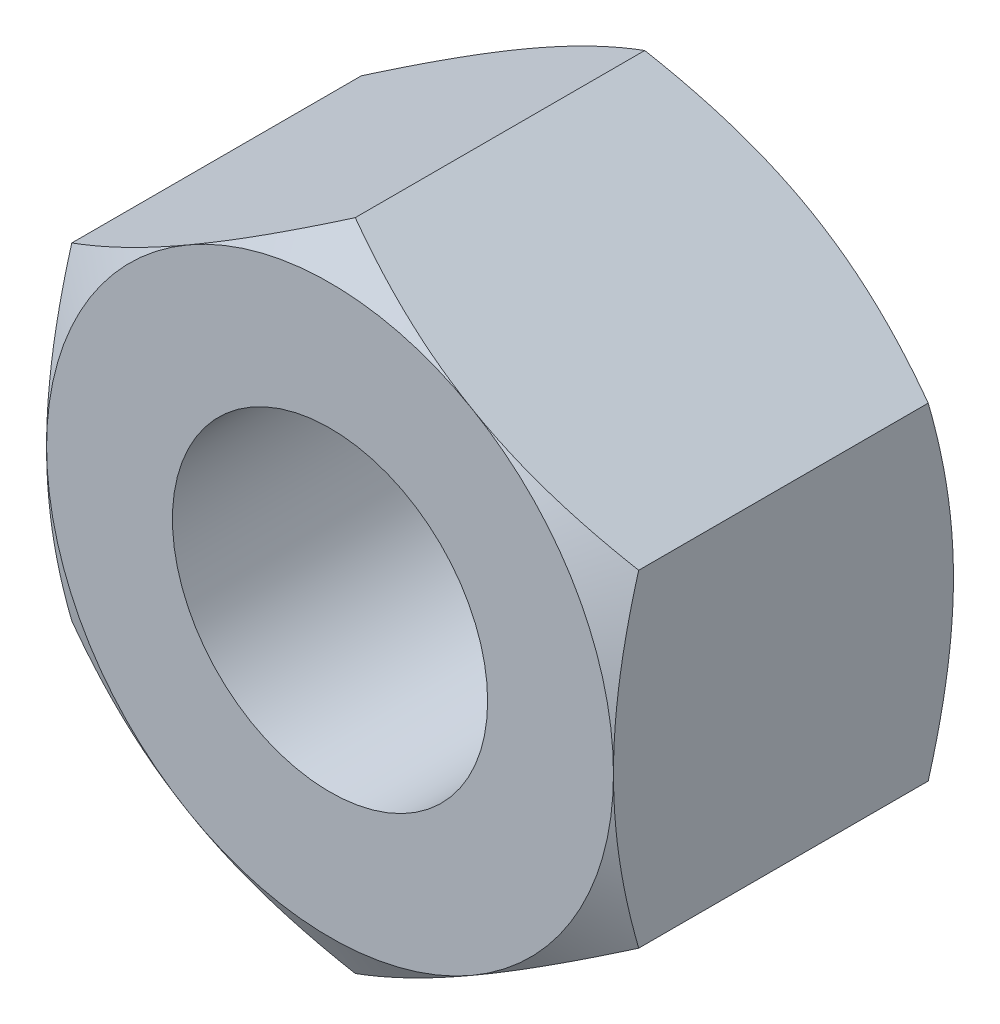
ISO-10303-21;
HEADER;
FILE_DESCRIPTION(('STEP AP214'),'2;1');
FILE_NAME('part.step','',(''),(''),'','','');
FILE_SCHEMA(('AUTOMOTIVE_DESIGN { 1 0 10303 214 1 1 1 1 }'));
ENDSEC;
DATA;
#1=APPLICATION_CONTEXT('core data for automotive mechanical design processes');
#2=APPLICATION_PROTOCOL_DEFINITION('international standard','automotive_design',2000,#1);
#3=PRODUCT_CONTEXT('',#1,'mechanical');
#4=PRODUCT('Part','Part','',(#3));
#5=PRODUCT_RELATED_PRODUCT_CATEGORY('part','',(#4));
#6=PRODUCT_DEFINITION_FORMATION('','',#4);
#7=PRODUCT_DEFINITION_CONTEXT('part definition',#1,'design');
#8=PRODUCT_DEFINITION('design','',#6,#7);
#9=PRODUCT_DEFINITION_SHAPE('','',#8);
#10=(LENGTH_UNIT() NAMED_UNIT(*) SI_UNIT(.MILLI.,.METRE.));
#11=(NAMED_UNIT(*) PLANE_ANGLE_UNIT() SI_UNIT($,.RADIAN.));
#12=(NAMED_UNIT(*) SI_UNIT($,.STERADIAN.) SOLID_ANGLE_UNIT());
#13=UNCERTAINTY_MEASURE_WITH_UNIT(LENGTH_MEASURE(1.E-05),#10,'distance_accuracy_value','');
#14=(GEOMETRIC_REPRESENTATION_CONTEXT(3) GLOBAL_UNCERTAINTY_ASSIGNED_CONTEXT((#13)) GLOBAL_UNIT_ASSIGNED_CONTEXT((#10,
#11,#12)) REPRESENTATION_CONTEXT('',''));
#15=CARTESIAN_POINT('',(0.,0.,0.));
#16=DIRECTION('',(0.,0.,1.));
#17=DIRECTION('',(1.,0.,0.));
#18=AXIS2_PLACEMENT_3D('',#15,#16,#17);
#19=CARTESIAN_POINT('',(0.,8.24155962262807,-8.5598));
#20=DIRECTION('',(-0.500000000000001,0.866025403784438,0.));
#21=DIRECTION('',(-0.866025403784438,-0.500000000000001,0.));
#22=AXIS2_PLACEMENT_3D('',#19,#20,#21);
#23=PLANE('',#22);
#24=DIRECTION('',(0.,0.,1.));
#25=VECTOR('',#24,1.);
#26=CARTESIAN_POINT('',(-7.1374,4.12077981131403,-8.5598));
#27=LINE('',#26,#25);
#28=CARTESIAN_POINT('',(-7.1374,4.12077981131405,-7.9248));
#29=VERTEX_POINT('',#28);
#30=CARTESIAN_POINT('',(-7.1374,4.12077981131403,-0.634999999999996));
#31=VERTEX_POINT('',#30);
#32=EDGE_CURVE('E163',#29,#31,#27,.T.);
#33=ORIENTED_EDGE('',*,*,#32,.T.);
#34=CARTESIAN_POINT('',(-7.1376,4.12066434126019,-0.635066407993581));
#35=CARTESIAN_POINT('',(-6.98076647484934,4.21121221922388,-0.583000288783407));
#36=CARTESIAN_POINT('',(-6.82335257460106,4.30209517690642,-0.533297818026336));
#37=CARTESIAN_POINT('',(-6.50725643555729,4.48459336787314,-0.439269681753373));
#38=CARTESIAN_POINT('',(-6.34857368567719,4.57620889623216,-0.394946312619536));
#39=CARTESIAN_POINT('',(-5.87000596411676,4.85251009910054,-0.270913911740814));
#40=CARTESIAN_POINT('',(-5.54824691951738,5.03827777011419,-0.200362540472032));
#41=CARTESIAN_POINT('',(-5.06673137153193,5.31628090136258,-0.117608359317688));
#42=CARTESIAN_POINT('',(-4.90840201346526,5.407692398863,-0.0940278001674196));
#43=CARTESIAN_POINT('',(-4.59103316203148,5.5909253906707,-0.0544777987104414));
#44=CARTESIAN_POINT('',(-4.43199373207493,5.68274684836787,-0.0385076899774345));
#45=CARTESIAN_POINT('',(-4.11363981497499,5.8665485681031,-0.0145841603820937));
#46=CARTESIAN_POINT('',(-3.954325839264,5.95852853486551,-0.00662173202293361));
#47=CARTESIAN_POINT('',(-3.63555964308717,6.14256828403675,0.00112449461758829));
#48=CARTESIAN_POINT('',(-3.47610742698757,6.23462806392474,0.000908542426211805));
#49=CARTESIAN_POINT('',(-3.03899670478565,6.48699405705369,-0.0109328282219934));
#50=CARTESIAN_POINT('',(-2.76147915657837,6.64721888821601,-0.0309109182896473));
#51=CARTESIAN_POINT('',(-2.20827221712257,6.96661306362839,-0.0943334019128988));
#52=CARTESIAN_POINT('',(-1.93258473918294,7.12578130322904,-0.137799332626333));
#53=CARTESIAN_POINT('',(-1.37827011982301,7.44581499793224,-0.246478861077877));
#54=CARTESIAN_POINT('',(-1.09971191681562,7.60664065142354,-0.312150254483647));
#55=CARTESIAN_POINT('',(-0.54672023974519,7.92591054503977,-0.461222792086858));
#56=CARTESIAN_POINT('',(-0.272279791691294,8.08435881160021,-0.544589172809348));
#57=CARTESIAN_POINT('',(0.000200000000000839,8.24167509268191,-0.635066407993585));
#58=B_SPLINE_CURVE_WITH_KNOTS('',3,(#34,#35,#36,#37,#38,#39,#40,#41,#42,#43,#44,#45,#46,#47,#48,
#49,#50,#51,#52,#53,#54,#55,#56,#57),.UNSPECIFIED.,.F.,.F.,(4,2,2,2,2,2,2,2,2,2,2,4),(0.,
0.565250699787999,1.13074186710046,2.26405155735559,2.81693591615959,3.36977185149424,
3.92198522745296,4.47418175506626,5.43639409933182,6.39949024436028,7.38379317493729,
8.36617995763132),.UNSPECIFIED.);
#59=CARTESIAN_POINT('',(-3.56870000000001,6.18116971697105,0.));
#60=VERTEX_POINT('',#59);
#61=EDGE_CURVE('E59',#31,#60,#58,.T.);
#62=ORIENTED_EDGE('',*,*,#61,.T.);
#63=CARTESIAN_POINT('',(0.,8.24155962262807,-0.635));
#64=VERTEX_POINT('',#63);
#65=EDGE_CURVE('E205',#60,#64,#58,.T.);
#66=ORIENTED_EDGE('',*,*,#65,.T.);
#67=DIRECTION('',(0.,0.,1.));
#68=VECTOR('',#67,1.);
#69=CARTESIAN_POINT('',(0.,8.24155962262807,-8.5598));
#70=LINE('',#69,#68);
#71=CARTESIAN_POINT('',(0.,8.24155962262807,-7.9248));
#72=VERTEX_POINT('',#71);
#73=EDGE_CURVE('E148',#72,#64,#70,.T.);
#74=ORIENTED_EDGE('',*,*,#73,.F.);
#75=CARTESIAN_POINT('',(-7.1376,4.12066434126019,-7.92473359200642));
#76=CARTESIAN_POINT('',(-6.98076647484934,4.21121221922388,-7.97679971121659));
#77=CARTESIAN_POINT('',(-6.82335257460106,4.30209517690642,-8.02650218197367));
#78=CARTESIAN_POINT('',(-6.50725643555729,4.48459336787314,-8.12053031824663));
#79=CARTESIAN_POINT('',(-6.3485736856772,4.57620889623216,-8.16485368738046));
#80=CARTESIAN_POINT('',(-5.87000596411677,4.85251009910054,-8.28888608825919));
#81=CARTESIAN_POINT('',(-5.54824691951738,5.03827777011419,-8.35943745952797));
#82=CARTESIAN_POINT('',(-5.06673137153194,5.31628090136258,-8.44219164068231));
#83=CARTESIAN_POINT('',(-4.90840201346526,5.407692398863,-8.46577219983258));
#84=CARTESIAN_POINT('',(-4.59103316203148,5.59092539067069,-8.50532220128956));
#85=CARTESIAN_POINT('',(-4.43199373207493,5.68274684836787,-8.52129231002257));
#86=CARTESIAN_POINT('',(-4.11363981497499,5.86654856810309,-8.54521583961791));
#87=CARTESIAN_POINT('',(-3.954325839264,5.95852853486551,-8.55317826797707));
#88=CARTESIAN_POINT('',(-3.63555964308717,6.14256828403675,-8.56092449461759));
#89=CARTESIAN_POINT('',(-3.47610742698757,6.23462806392474,-8.56070854242621));
#90=CARTESIAN_POINT('',(-3.03899670478565,6.48699405705369,-8.54886717177801));
#91=CARTESIAN_POINT('',(-2.76147915657837,6.64721888821601,-8.52888908171035));
#92=CARTESIAN_POINT('',(-2.20827221712257,6.96661306362838,-8.4654665980871));
#93=CARTESIAN_POINT('',(-1.93258473918294,7.12578130322904,-8.42200066737367));
#94=CARTESIAN_POINT('',(-1.378270119823,7.44581499793224,-8.31332113892212));
#95=CARTESIAN_POINT('',(-1.09971191681562,7.60664065142354,-8.24764974551636));
#96=CARTESIAN_POINT('',(-0.54672023974519,7.92591054503977,-8.09857720791314));
#97=CARTESIAN_POINT('',(-0.272279791691295,8.08435881160021,-8.01521082719065));
#98=CARTESIAN_POINT('',(0.000200000000000537,8.24167509268191,-7.92473359200642));
#99=B_SPLINE_CURVE_WITH_KNOTS('',3,(#75,#76,#77,#78,#79,#80,#81,#82,#83,#84,#85,#86,#87,#88,#89,
#90,#91,#92,#93,#94,#95,#96,#97,#98),.UNSPECIFIED.,.F.,.F.,(4,2,2,2,2,2,2,2,2,2,2,4),(0.,
0.565250699787998,1.13074186710046,2.26405155735559,2.81693591615959,3.36977185149424,
3.92198522745296,4.47418175506626,5.43639409933182,6.39949024436028,7.38379317493729,
8.36617995763132),.UNSPECIFIED.);
#100=CARTESIAN_POINT('',(-3.56870000000001,6.18116971697105,-8.5598));
#101=VERTEX_POINT('',#100);
#102=EDGE_CURVE('E249',#101,#72,#99,.T.);
#103=ORIENTED_EDGE('',*,*,#102,.F.);
#104=EDGE_CURVE('E193',#29,#101,#99,.T.);
#105=ORIENTED_EDGE('',*,*,#104,.F.);
#106=EDGE_LOOP('',(#33,#62,#66,#74,#103,#105));
#107=FACE_BOUND('',#106,.T.);
#108=ADVANCED_FACE('F35',(#107),#23,.T.);
#109=CARTESIAN_POINT('',(7.1374,4.12077981131403,-8.5598));
#110=DIRECTION('',(0.500000000000001,0.866025403784438,0.));
#111=DIRECTION('',(-0.866025403784438,0.500000000000001,0.));
#112=AXIS2_PLACEMENT_3D('',#109,#110,#111);
#113=PLANE('',#112);
#114=ORIENTED_EDGE('',*,*,#73,.T.);
#115=CARTESIAN_POINT('',(-0.000199999999999747,8.24167509268191,-0.635066407993585));
#116=CARTESIAN_POINT('',(0.156633525150658,8.15112721471822,-0.583000288783411));
#117=CARTESIAN_POINT('',(0.314047425398939,8.06024425703569,-0.53329781802634));
#118=CARTESIAN_POINT('',(0.630143564442708,7.87774606606897,-0.439269681753377));
#119=CARTESIAN_POINT('',(0.788826314322805,7.78613053770994,-0.39494631261954));
#120=CARTESIAN_POINT('',(1.26739403588324,7.50982933484156,-0.270913911740818));
#121=CARTESIAN_POINT('',(1.58915308048262,7.32406166382791,-0.200362540472036));
#122=CARTESIAN_POINT('',(2.07066862846807,7.04605853257952,-0.11760835931769));
#123=CARTESIAN_POINT('',(2.22899798653474,6.9546470350791,-0.0940278001674207));
#124=CARTESIAN_POINT('',(2.54636683796852,6.77141404327141,-0.0544777987104423));
#125=CARTESIAN_POINT('',(2.70540626792507,6.67959258557423,-0.038507689977436));
#126=CARTESIAN_POINT('',(3.02376018502501,6.49579086583901,-0.0145841603820951));
#127=CARTESIAN_POINT('',(3.183074160736,6.4038108990766,-0.00662173202293451));
#128=CARTESIAN_POINT('',(3.50184035691283,6.21977114990535,0.00112449461758819));
#129=CARTESIAN_POINT('',(3.66129257301243,6.12771137001736,0.000908542426211946));
#130=CARTESIAN_POINT('',(4.09840329521436,5.87534537688841,-0.0109328282219926));
#131=CARTESIAN_POINT('',(4.37592084342163,5.7151205457261,-0.030910918289646));
#132=CARTESIAN_POINT('',(4.92912778287743,5.39572637031372,-0.094333401912897));
#133=CARTESIAN_POINT('',(5.20481526081706,5.23655813071306,-0.137799332626331));
#134=CARTESIAN_POINT('',(5.759129880177,4.91652443600986,-0.246478861077875));
#135=CARTESIAN_POINT('',(6.03768808318438,4.75569878251857,-0.312150254483645));
#136=CARTESIAN_POINT('',(6.59067976025481,4.43642888890233,-0.461222792086854));
#137=CARTESIAN_POINT('',(6.86512020830871,4.2779806223419,-0.544589172809344));
#138=CARTESIAN_POINT('',(7.1376,4.12066434126019,-0.63506640799358));
#139=B_SPLINE_CURVE_WITH_KNOTS('',3,(#115,#116,#117,#118,#119,#120,#121,#122,#123,#124,#125,
#126,#127,#128,#129,#130,#131,#132,#133,#134,#135,#136,#137,#138),.UNSPECIFIED.,.F.,.F.,(4,2,2,
2,2,2,2,2,2,2,2,4),(0.,0.565250699787998,1.13074186710046,2.26405155735559,2.81693591615959,
3.36977185149424,3.92198522745297,4.47418175506626,5.43639409933182,6.39949024436028,
7.38379317493729,8.36617995763132),.UNSPECIFIED.);
#140=CARTESIAN_POINT('',(3.56870000000001,6.18116971697105,0.));
#141=VERTEX_POINT('',#140);
#142=EDGE_CURVE('E141',#64,#141,#139,.T.);
#143=ORIENTED_EDGE('',*,*,#142,.T.);
#144=CARTESIAN_POINT('',(7.1374,4.12077981131405,-0.635));
#145=VERTEX_POINT('',#144);
#146=EDGE_CURVE('E127',#141,#145,#139,.T.);
#147=ORIENTED_EDGE('',*,*,#146,.T.);
#148=DIRECTION('',(0.,0.,1.));
#149=VECTOR('',#148,1.);
#150=CARTESIAN_POINT('',(7.1374,4.12077981131403,-8.5598));
#151=LINE('',#150,#149);
#152=CARTESIAN_POINT('',(7.1374,4.12077981131405,-7.9248));
#153=VERTEX_POINT('',#152);
#154=EDGE_CURVE('E140',#153,#145,#151,.T.);
#155=ORIENTED_EDGE('',*,*,#154,.F.);
#156=CARTESIAN_POINT('',(-0.000199999999999566,8.24167509268191,-7.92473359200642));
#157=CARTESIAN_POINT('',(0.156633525150658,8.15112721471822,-7.97679971121659));
#158=CARTESIAN_POINT('',(0.314047425398939,8.06024425703569,-8.02650218197366));
#159=CARTESIAN_POINT('',(0.630143564442708,7.87774606606897,-8.12053031824662));
#160=CARTESIAN_POINT('',(0.788826314322805,7.78613053770994,-8.16485368738046));
#161=CARTESIAN_POINT('',(1.26739403588324,7.50982933484156,-8.28888608825918));
#162=CARTESIAN_POINT('',(1.58915308048262,7.32406166382791,-8.35943745952797));
#163=CARTESIAN_POINT('',(2.07066862846807,7.04605853257952,-8.44219164068231));
#164=CARTESIAN_POINT('',(2.22899798653474,6.9546470350791,-8.46577219983258));
#165=CARTESIAN_POINT('',(2.54636683796852,6.77141404327141,-8.50532220128956));
#166=CARTESIAN_POINT('',(2.70540626792507,6.67959258557423,-8.52129231002257));
#167=CARTESIAN_POINT('',(3.02376018502501,6.49579086583901,-8.54521583961791));
#168=CARTESIAN_POINT('',(3.183074160736,6.4038108990766,-8.55317826797707));
#169=CARTESIAN_POINT('',(3.50184035691283,6.21977114990535,-8.56092449461759));
#170=CARTESIAN_POINT('',(3.66129257301243,6.12771137001736,-8.56070854242621));
#171=CARTESIAN_POINT('',(4.09840329521436,5.87534537688841,-8.54886717177801));
#172=CARTESIAN_POINT('',(4.37592084342163,5.7151205457261,-8.52888908171036));
#173=CARTESIAN_POINT('',(4.92912778287743,5.39572637031372,-8.4654665980871));
#174=CARTESIAN_POINT('',(5.20481526081706,5.23655813071306,-8.42200066737367));
#175=CARTESIAN_POINT('',(5.759129880177,4.91652443600986,-8.31332113892213));
#176=CARTESIAN_POINT('',(6.03768808318438,4.75569878251857,-8.24764974551636));
#177=CARTESIAN_POINT('',(6.59067976025481,4.43642888890233,-8.09857720791315));
#178=CARTESIAN_POINT('',(6.86512020830871,4.27798062234189,-8.01521082719066));
#179=CARTESIAN_POINT('',(7.1376,4.12066434126019,-7.92473359200642));
#180=B_SPLINE_CURVE_WITH_KNOTS('',3,(#156,#157,#158,#159,#160,#161,#162,#163,#164,#165,#166,
#167,#168,#169,#170,#171,#172,#173,#174,#175,#176,#177,#178,#179),.UNSPECIFIED.,.F.,.F.,(4,2,2,
2,2,2,2,2,2,2,2,4),(0.,0.565250699787998,1.13074186710046,2.26405155735559,2.81693591615959,
3.36977185149424,3.92198522745297,4.47418175506626,5.43639409933182,6.39949024436028,
7.38379317493729,8.36617995763132),.UNSPECIFIED.);
#181=CARTESIAN_POINT('',(3.56870000000001,6.18116971697105,-8.5598));
#182=VERTEX_POINT('',#181);
#183=EDGE_CURVE('E250',#182,#153,#180,.T.);
#184=ORIENTED_EDGE('',*,*,#183,.F.);
#185=EDGE_CURVE('E256',#72,#182,#180,.T.);
#186=ORIENTED_EDGE('',*,*,#185,.F.);
#187=EDGE_LOOP('',(#114,#143,#147,#155,#184,#186));
#188=FACE_BOUND('',#187,.T.);
#189=ADVANCED_FACE('F138',(#188),#113,.T.);
#190=CARTESIAN_POINT('',(7.1374,4.12077981131403,-8.5598));
#191=DIRECTION('',(-1.,0.,0.));
#192=DIRECTION('',(0.,0.,1.));
#193=AXIS2_PLACEMENT_3D('',#190,#191,#192);
#194=PLANE('',#193);
#195=CARTESIAN_POINT('',(7.1374,-10.9289395426977,-3.40212444228359));
#196=CARTESIAN_POINT('',(7.1374,-10.6154635817948,-3.25122638772321));
#197=CARTESIAN_POINT('',(7.1374,-10.3012508695004,-3.10183117497707));
#198=CARTESIAN_POINT('',(7.1374,-9.67095378484644,-2.80690488527945));
#199=CARTESIAN_POINT('',(7.1374,-9.35486910147517,-2.66137447378699));
#200=CARTESIAN_POINT('',(7.1374,-8.71873458214205,-2.37427503681389));
#201=CARTESIAN_POINT('',(7.1374,-8.39867242075479,-2.23273322233473));
#202=CARTESIAN_POINT('',(7.1374,-7.75593406632731,-1.95573871882953));
#203=CARTESIAN_POINT('',(7.1374,-7.43325800974002,-1.82028571433686));
#204=CARTESIAN_POINT('',(7.1374,-6.78083888090768,-1.5555037698329));
#205=CARTESIAN_POINT('',(7.1374,-6.45105752995635,-1.4262686246965));
#206=CARTESIAN_POINT('',(7.1374,-5.78763279064692,-1.17793065386017));
#207=CARTESIAN_POINT('',(7.1374,-5.45398898108492,-1.05882894527158));
#208=CARTESIAN_POINT('',(7.1374,-4.78299036905997,-0.83395497990328));
#209=CARTESIAN_POINT('',(7.1374,-4.44564510501881,-0.728154571723957));
#210=CARTESIAN_POINT('',(7.1374,-3.76620693852753,-0.533314600544376));
#211=CARTESIAN_POINT('',(7.1374,-3.42411556116821,-0.444269781463661));
#212=CARTESIAN_POINT('',(7.1374,-2.73489865633509,-0.28726193323908));
#213=CARTESIAN_POINT('',(7.1374,-2.38777181981325,-0.219304492763014));
#214=CARTESIAN_POINT('',(7.1374,-1.86405100187748,-0.136576799016611));
#215=CARTESIAN_POINT('',(7.1374,-1.68895075507129,-0.11220051066193));
#216=CARTESIAN_POINT('',(7.1374,-1.33793571374785,-0.0703288163036734));
#217=CARTESIAN_POINT('',(7.1374,-1.1620210008322,-0.0528327354442441));
#218=CARTESIAN_POINT('',(7.1374,-0.810715034232588,-0.0251899276247963));
#219=CARTESIAN_POINT('',(7.1374,-0.635327342679126,-0.0149981124121293));
#220=CARTESIAN_POINT('',(7.1374,-0.284278243857442,-0.00201936336542326));
#221=CARTESIAN_POINT('',(7.1374,-0.108616840082167,0.000767664202011745));
#222=CARTESIAN_POINT('',(7.1374,0.242616648916922,-0.00112935755093126));
#223=CARTESIAN_POINT('',(7.1374,0.418188745357269,-0.00581129872345775));
#224=CARTESIAN_POINT('',(7.1374,0.768984583273012,-0.0225300872791847));
#225=CARTESIAN_POINT('',(7.1374,0.944208307307772,-0.0345672940293902));
#226=CARTESIAN_POINT('',(7.1374,1.37016195209916,-0.0725176570540157));
#227=CARTESIAN_POINT('',(7.1374,1.62056258956133,-0.102189895959793));
#228=CARTESIAN_POINT('',(7.1374,2.11945029360771,-0.174899491584615));
#229=CARTESIAN_POINT('',(7.1374,2.36793681666567,-0.217940510778794));
#230=CARTESIAN_POINT('',(7.1374,2.86279222940919,-0.31585093943033));
#231=CARTESIAN_POINT('',(7.1374,3.10915887310501,-0.370731592259024));
#232=CARTESIAN_POINT('',(7.1374,3.59936313396368,-0.490636929103907));
#233=CARTESIAN_POINT('',(7.1374,3.8432009871228,-0.555660657277427));
#234=CARTESIAN_POINT('',(7.1374,4.33433744176471,-0.695983365408944));
#235=CARTESIAN_POINT('',(7.1374,4.58157496654842,-0.771494641120654));
#236=CARTESIAN_POINT('',(7.1374,5.07344503012105,-0.92997782189367));
#237=CARTESIAN_POINT('',(7.1374,5.31807924229731,-1.01294456435955));
#238=CARTESIAN_POINT('',(7.1374,5.80375738728497,-1.18461913061447));
#239=CARTESIAN_POINT('',(7.1374,6.04481379528881,-1.27329187323748));
#240=CARTESIAN_POINT('',(7.1374,6.52506702501308,-1.4558358315545));
#241=CARTESIAN_POINT('',(7.1374,6.76426304524185,-1.5497091600778));
#242=CARTESIAN_POINT('',(7.1374,7.00259534063412,-1.64566650559858));
#243=B_SPLINE_CURVE_WITH_KNOTS('',3,(#195,#196,#197,#198,#199,#200,#201,#202,#203,#204,#205,
#206,#207,#208,#209,#210,#211,#212,#213,#214,#215,#216,#217,#218,#219,#220,#221,#222,#223,#224,
#225,#226,#227,#228,#229,#230,#231,#232,#233,#234,#235,#236,#237,#238,#239,#240,#241,#242),
.UNSPECIFIED.,.F.,.F.,(4,2,2,2,2,2,2,2,2,2,2,2,2,2,2,2,2,2,2,2,2,2,2,4),(0.,1.04372682978986,
2.08763222306161,3.13746981901196,4.18725295910565,5.24972306581389,6.3123101480114,
7.37260905117527,8.43257479142203,9.49282120889555,10.023073813765,10.5532743950021,
11.0801732502588,11.6070654357422,12.1338089300003,12.6605781621965,13.416613608991,
14.1728563601815,14.9298204548908,15.6867132593905,16.4621053940236,17.236964680084,
18.0074465273937,18.7782437253039),.UNSPECIFIED.);
#244=CARTESIAN_POINT('',(7.1374,-4.12077981131405,-0.635));
#245=VERTEX_POINT('',#244);
#246=CARTESIAN_POINT('',(7.1374,0.,0.));
#247=VERTEX_POINT('',#246);
#248=EDGE_CURVE('E133',#245,#247,#243,.T.);
#249=ORIENTED_EDGE('',*,*,#248,.F.);
#250=DIRECTION('',(0.,0.,1.));
#251=VECTOR('',#250,1.);
#252=CARTESIAN_POINT('',(7.1374,-4.12077981131405,-8.5598));
#253=LINE('',#252,#251);
#254=CARTESIAN_POINT('',(7.1374,-4.12077981131405,-7.9248));
#255=VERTEX_POINT('',#254);
#256=EDGE_CURVE('E149',#255,#245,#253,.T.);
#257=ORIENTED_EDGE('',*,*,#256,.F.);
#258=CARTESIAN_POINT('',(7.1374,-10.9289395426977,-5.15767555771642));
#259=CARTESIAN_POINT('',(7.1374,-10.6154635817948,-5.30857361227679));
#260=CARTESIAN_POINT('',(7.1374,-10.3012508695004,-5.45796882502293));
#261=CARTESIAN_POINT('',(7.1374,-9.67095378484644,-5.75289511472055));
#262=CARTESIAN_POINT('',(7.1374,-9.35486910147517,-5.89842552621301));
#263=CARTESIAN_POINT('',(7.1374,-8.71873458214205,-6.18552496318611));
#264=CARTESIAN_POINT('',(7.1374,-8.39867242075479,-6.32706677766527));
#265=CARTESIAN_POINT('',(7.1374,-7.75593406632731,-6.60406128117047));
#266=CARTESIAN_POINT('',(7.1374,-7.43325800974002,-6.73951428566314));
#267=CARTESIAN_POINT('',(7.1374,-6.78083888090768,-7.0042962301671));
#268=CARTESIAN_POINT('',(7.1374,-6.45105752995635,-7.1335313753035));
#269=CARTESIAN_POINT('',(7.1374,-5.78763279064692,-7.38186934613983));
#270=CARTESIAN_POINT('',(7.1374,-5.45398898108492,-7.50097105472842));
#271=CARTESIAN_POINT('',(7.1374,-4.78299036905997,-7.72584502009672));
#272=CARTESIAN_POINT('',(7.1374,-4.44564510501881,-7.83164542827604));
#273=CARTESIAN_POINT('',(7.1374,-3.76620693852753,-8.02648539945562));
#274=CARTESIAN_POINT('',(7.1374,-3.42411556116821,-8.11553021853634));
#275=CARTESIAN_POINT('',(7.1374,-2.73489865633509,-8.27253806676092));
#276=CARTESIAN_POINT('',(7.1374,-2.38777181981325,-8.34049550723699));
#277=CARTESIAN_POINT('',(7.1374,-1.86405100187748,-8.42322320098339));
#278=CARTESIAN_POINT('',(7.1374,-1.68895075507129,-8.44759948933807));
#279=CARTESIAN_POINT('',(7.1374,-1.33793571374786,-8.48947118369633));
#280=CARTESIAN_POINT('',(7.1374,-1.1620210008322,-8.50696726455576));
#281=CARTESIAN_POINT('',(7.1374,-0.810715034232589,-8.53461007237521));
#282=CARTESIAN_POINT('',(7.1374,-0.635327342679127,-8.54480188758787));
#283=CARTESIAN_POINT('',(7.1374,-0.284278243857443,-8.55778063663458));
#284=CARTESIAN_POINT('',(7.1374,-0.108616840082168,-8.56056766420201));
#285=CARTESIAN_POINT('',(7.1374,0.242616648916921,-8.55867064244907));
#286=CARTESIAN_POINT('',(7.1374,0.418188745357268,-8.55398870127654));
#287=CARTESIAN_POINT('',(7.1374,0.768984583273011,-8.53726991272082));
#288=CARTESIAN_POINT('',(7.1374,0.944208307307771,-8.52523270597061));
#289=CARTESIAN_POINT('',(7.1374,1.37016195209916,-8.48728234294598));
#290=CARTESIAN_POINT('',(7.1374,1.62056258956133,-8.45761010404021));
#291=CARTESIAN_POINT('',(7.1374,2.11945029360771,-8.38490050841539));
#292=CARTESIAN_POINT('',(7.1374,2.36793681666567,-8.34185948922121));
#293=CARTESIAN_POINT('',(7.1374,2.86279222940919,-8.24394906056967));
#294=CARTESIAN_POINT('',(7.1374,3.10915887310501,-8.18906840774098));
#295=CARTESIAN_POINT('',(7.1374,3.59936313396368,-8.06916307089609));
#296=CARTESIAN_POINT('',(7.1374,3.84320098712281,-8.00413934272257));
#297=CARTESIAN_POINT('',(7.1374,4.33433744176471,-7.86381663459106));
#298=CARTESIAN_POINT('',(7.1374,4.58157496654843,-7.78830535887935));
#299=CARTESIAN_POINT('',(7.1374,5.07344503012105,-7.62982217810633));
#300=CARTESIAN_POINT('',(7.1374,5.31807924229731,-7.54685543564045));
#301=CARTESIAN_POINT('',(7.1374,5.80375738728497,-7.37518086938553));
#302=CARTESIAN_POINT('',(7.1374,6.04481379528881,-7.28650812676252));
#303=CARTESIAN_POINT('',(7.1374,6.52506702501308,-7.10396416844551));
#304=CARTESIAN_POINT('',(7.1374,6.76426304524185,-7.0100908399222));
#305=CARTESIAN_POINT('',(7.1374,7.00259534063412,-6.91413349440142));
#306=B_SPLINE_CURVE_WITH_KNOTS('',3,(#258,#259,#260,#261,#262,#263,#264,#265,#266,#267,#268,
#269,#270,#271,#272,#273,#274,#275,#276,#277,#278,#279,#280,#281,#282,#283,#284,#285,#286,#287,
#288,#289,#290,#291,#292,#293,#294,#295,#296,#297,#298,#299,#300,#301,#302,#303,#304,#305),
.UNSPECIFIED.,.F.,.F.,(4,2,2,2,2,2,2,2,2,2,2,2,2,2,2,2,2,2,2,2,2,2,2,4),(0.,1.04372682978986,
2.08763222306161,3.13746981901196,4.18725295910565,5.24972306581389,6.3123101480114,
7.37260905117527,8.43257479142203,9.49282120889555,10.023073813765,10.5532743950021,
11.0801732502588,11.6070654357422,12.1338089300003,12.6605781621965,13.416613608991,
14.1728563601815,14.9298204548908,15.6867132593905,16.4621053940236,17.236964680084,
18.0074465273937,18.7782437253039),.UNSPECIFIED.);
#307=CARTESIAN_POINT('',(7.1374,0.,-8.5598));
#308=VERTEX_POINT('',#307);
#309=EDGE_CURVE('E240',#255,#308,#306,.T.);
#310=ORIENTED_EDGE('',*,*,#309,.T.);
#311=EDGE_CURVE('E147',#308,#153,#306,.T.);
#312=ORIENTED_EDGE('',*,*,#311,.T.);
#313=ORIENTED_EDGE('',*,*,#154,.T.);
#314=EDGE_CURVE('E124',#247,#145,#243,.T.);
#315=ORIENTED_EDGE('',*,*,#314,.F.);
#316=EDGE_LOOP('',(#249,#257,#310,#312,#313,#315));
#317=FACE_BOUND('',#316,.T.);
#318=ADVANCED_FACE('F144',(#317),#194,.F.);
#319=CARTESIAN_POINT('',(0.,-8.24155962262809,-8.5598));
#320=DIRECTION('',(0.500000000000001,-0.866025403784438,0.));
#321=DIRECTION('',(0.866025403784438,0.500000000000001,0.));
#322=AXIS2_PLACEMENT_3D('',#319,#320,#321);
#323=PLANE('',#322);
#324=ORIENTED_EDGE('',*,*,#256,.T.);
#325=CARTESIAN_POINT('',(7.1376,-4.12066434126021,-0.635066407993586));
#326=CARTESIAN_POINT('',(6.98076647484934,-4.2112122192239,-0.583000288783413));
#327=CARTESIAN_POINT('',(6.82335257460106,-4.30209517690644,-0.533297818026342));
#328=CARTESIAN_POINT('',(6.50725643555729,-4.48459336787316,-0.439269681753379));
#329=CARTESIAN_POINT('',(6.34857368567719,-4.57620889623218,-0.394946312619542));
#330=CARTESIAN_POINT('',(5.87000596411676,-4.85251009910056,-0.27091391174082));
#331=CARTESIAN_POINT('',(5.54824691951738,-5.03827777011421,-0.200362540472039));
#332=CARTESIAN_POINT('',(5.06673137153193,-5.3162809013626,-0.117608359317695));
#333=CARTESIAN_POINT('',(4.90840201346526,-5.40769239886302,-0.0940278001674268));
#334=CARTESIAN_POINT('',(4.59103316203148,-5.59092539067072,-0.0544777987104492));
#335=CARTESIAN_POINT('',(4.43199373207493,-5.68274684836789,-0.0385076899774431));
#336=CARTESIAN_POINT('',(4.11363981497499,-5.86654856810312,-0.014584160382103));
#337=CARTESIAN_POINT('',(3.954325839264,-5.95852853486553,-0.00662173202294295));
#338=CARTESIAN_POINT('',(3.63555964308717,-6.14256828403677,0.00112449461757892));
#339=CARTESIAN_POINT('',(3.47610742698757,-6.23462806392476,0.000908542426202436));
#340=CARTESIAN_POINT('',(3.03899670478564,-6.48699405705371,-0.010932828222003));
#341=CARTESIAN_POINT('',(2.76147915657837,-6.64721888821603,-0.0309109182896572));
#342=CARTESIAN_POINT('',(2.20827221712257,-6.96661306362841,-0.0943334019129094));
#343=CARTESIAN_POINT('',(1.93258473918293,-7.12578130322906,-0.137799332626344));
#344=CARTESIAN_POINT('',(1.378270119823,-7.44581499793226,-0.246478861077889));
#345=CARTESIAN_POINT('',(1.09971191681561,-7.60664065142356,-0.312150254483659));
#346=CARTESIAN_POINT('',(0.54672023974519,-7.92591054503979,-0.461222792086869));
#347=CARTESIAN_POINT('',(0.272279791691295,-8.08435881160023,-0.54458917280936));
#348=CARTESIAN_POINT('',(-0.000199999999999839,-8.24167509268193,-0.635066407993596));
#349=B_SPLINE_CURVE_WITH_KNOTS('',3,(#325,#326,#327,#328,#329,#330,#331,#332,#333,#334,#335,
#336,#337,#338,#339,#340,#341,#342,#343,#344,#345,#346,#347,#348),.UNSPECIFIED.,.F.,.F.,(4,2,2,
2,2,2,2,2,2,2,2,4),(0.,0.565250699787999,1.13074186710046,2.26405155735559,2.81693591615959,
3.36977185149424,3.92198522745297,4.47418175506626,5.43639409933182,6.39949024436028,
7.38379317493729,8.36617995763132),.UNSPECIFIED.);
#350=CARTESIAN_POINT('',(3.56870000000001,-6.18116971697105,0.));
#351=VERTEX_POINT('',#350);
#352=EDGE_CURVE('E274',#245,#351,#349,.T.);
#353=ORIENTED_EDGE('',*,*,#352,.T.);
#354=CARTESIAN_POINT('',(0.,-8.24155962262807,-0.635));
#355=VERTEX_POINT('',#354);
#356=EDGE_CURVE('E275',#351,#355,#349,.T.);
#357=ORIENTED_EDGE('',*,*,#356,.T.);
#358=DIRECTION('',(0.,0.,1.));
#359=VECTOR('',#358,1.);
#360=CARTESIAN_POINT('',(0.,-8.24155962262809,-8.5598));
#361=LINE('',#360,#359);
#362=CARTESIAN_POINT('',(0.,-8.24155962262807,-7.9248));
#363=VERTEX_POINT('',#362);
#364=EDGE_CURVE('E154',#363,#355,#361,.T.);
#365=ORIENTED_EDGE('',*,*,#364,.F.);
#366=CARTESIAN_POINT('',(7.1376,-4.12066434126021,-7.92473359200642));
#367=CARTESIAN_POINT('',(6.98076647484934,-4.2112122192239,-7.97679971121659));
#368=CARTESIAN_POINT('',(6.82335257460106,-4.30209517690644,-8.02650218197366));
#369=CARTESIAN_POINT('',(6.50725643555729,-4.48459336787316,-8.12053031824662));
#370=CARTESIAN_POINT('',(6.34857368567719,-4.57620889623218,-8.16485368738046));
#371=CARTESIAN_POINT('',(5.87000596411676,-4.85251009910056,-8.28888608825918));
#372=CARTESIAN_POINT('',(5.54824691951738,-5.03827777011421,-8.35943745952796));
#373=CARTESIAN_POINT('',(5.06673137153193,-5.3162809013626,-8.44219164068231));
#374=CARTESIAN_POINT('',(4.90840201346526,-5.40769239886302,-8.46577219983257));
#375=CARTESIAN_POINT('',(4.59103316203148,-5.59092539067072,-8.50532220128955));
#376=CARTESIAN_POINT('',(4.43199373207493,-5.68274684836789,-8.52129231002256));
#377=CARTESIAN_POINT('',(4.11363981497499,-5.86654856810311,-8.5452158396179));
#378=CARTESIAN_POINT('',(3.954325839264,-5.95852853486553,-8.55317826797706));
#379=CARTESIAN_POINT('',(3.63555964308717,-6.14256828403677,-8.56092449461758));
#380=CARTESIAN_POINT('',(3.47610742698757,-6.23462806392476,-8.5607085424262));
#381=CARTESIAN_POINT('',(3.03899670478564,-6.48699405705371,-8.548867171778));
#382=CARTESIAN_POINT('',(2.76147915657837,-6.64721888821603,-8.52888908171034));
#383=CARTESIAN_POINT('',(2.20827221712257,-6.96661306362841,-8.46546659808709));
#384=CARTESIAN_POINT('',(1.93258473918293,-7.12578130322906,-8.42200066737366));
#385=CARTESIAN_POINT('',(1.378270119823,-7.44581499793226,-8.31332113892211));
#386=CARTESIAN_POINT('',(1.09971191681561,-7.60664065142356,-8.24764974551634));
#387=CARTESIAN_POINT('',(0.54672023974519,-7.92591054503979,-8.09857720791313));
#388=CARTESIAN_POINT('',(0.272279791691295,-8.08435881160023,-8.01521082719064));
#389=CARTESIAN_POINT('',(-0.000199999999999897,-8.24167509268193,-7.92473359200641));
#390=B_SPLINE_CURVE_WITH_KNOTS('',3,(#366,#367,#368,#369,#370,#371,#372,#373,#374,#375,#376,
#377,#378,#379,#380,#381,#382,#383,#384,#385,#386,#387,#388,#389),.UNSPECIFIED.,.F.,.F.,(4,2,2,
2,2,2,2,2,2,2,2,4),(0.,0.565250699787999,1.13074186710046,2.26405155735559,2.81693591615959,
3.36977185149424,3.92198522745297,4.47418175506626,5.43639409933182,6.39949024436028,
7.3837931749373,8.36617995763132),.UNSPECIFIED.);
#391=CARTESIAN_POINT('',(3.56870000000001,-6.18116971697105,-8.5598));
#392=VERTEX_POINT('',#391);
#393=EDGE_CURVE('E234',#392,#363,#390,.T.);
#394=ORIENTED_EDGE('',*,*,#393,.F.);
#395=EDGE_CURVE('E315',#255,#392,#390,.T.);
#396=ORIENTED_EDGE('',*,*,#395,.F.);
#397=EDGE_LOOP('',(#324,#353,#357,#365,#394,#396));
#398=FACE_BOUND('',#397,.T.);
#399=ADVANCED_FACE('F287',(#398),#323,.T.);
#400=CARTESIAN_POINT('',(-7.1374,-4.12077981131405,-8.5598));
#401=DIRECTION('',(-0.500000000000001,-0.866025403784438,0.));
#402=DIRECTION('',(0.866025403784438,-0.500000000000001,0.));
#403=AXIS2_PLACEMENT_3D('',#400,#401,#402);
#404=PLANE('',#403);
#405=ORIENTED_EDGE('',*,*,#364,.T.);
#406=CARTESIAN_POINT('',(0.000200000000000434,-8.24167509268193,-0.635066407993596));
#407=CARTESIAN_POINT('',(-0.156633525150658,-8.15112721471824,-0.583000288783421));
#408=CARTESIAN_POINT('',(-0.314047425398939,-8.06024425703571,-0.53329781802635));
#409=CARTESIAN_POINT('',(-0.630143564442709,-7.87774606606898,-0.439269681753387));
#410=CARTESIAN_POINT('',(-0.788826314322807,-7.78613053770996,-0.39494631261955));
#411=CARTESIAN_POINT('',(-1.26739403588324,-7.50982933484158,-0.270913911740828));
#412=CARTESIAN_POINT('',(-1.58915308048262,-7.32406166382793,-0.200362540472045));
#413=CARTESIAN_POINT('',(-2.07066862846807,-7.04605853257954,-0.117608359317699));
#414=CARTESIAN_POINT('',(-2.22899798653475,-6.95464703507912,-0.0940278001674308));
#415=CARTESIAN_POINT('',(-2.54636683796853,-6.77141404327142,-0.0544777987104523));
#416=CARTESIAN_POINT('',(-2.70540626792508,-6.67959258557425,-0.0385076899774454));
#417=CARTESIAN_POINT('',(-3.02376018502502,-6.49579086583902,-0.0145841603821042));
#418=CARTESIAN_POINT('',(-3.18307416073601,-6.40381089907661,-0.00662173202294385));
#419=CARTESIAN_POINT('',(-3.50184035691284,-6.21977114990537,0.00112449461757882));
#420=CARTESIAN_POINT('',(-3.66129257301244,-6.12771137001738,0.000908542426202874));
#421=CARTESIAN_POINT('',(-4.09840329521436,-5.87534537688843,-0.0109328282220013));
#422=CARTESIAN_POINT('',(-4.37592084342164,-5.71512054572611,-0.030910918289655));
#423=CARTESIAN_POINT('',(-4.92912778287744,-5.39572637031373,-0.0943334019129059));
#424=CARTESIAN_POINT('',(-5.20481526081707,-5.23655813071308,-0.13779933262634));
#425=CARTESIAN_POINT('',(-5.759129880177,-4.91652443600988,-0.246478861077883));
#426=CARTESIAN_POINT('',(-6.03768808318439,-4.75569878251858,-0.312150254483652));
#427=CARTESIAN_POINT('',(-6.59067976025481,-4.43642888890235,-0.461222792086861));
#428=CARTESIAN_POINT('',(-6.86512020830871,-4.27798062234191,-0.54458917280935));
#429=CARTESIAN_POINT('',(-7.1376,-4.12066434126021,-0.635066407993586));
#430=B_SPLINE_CURVE_WITH_KNOTS('',3,(#406,#407,#408,#409,#410,#411,#412,#413,#414,#415,#416,
#417,#418,#419,#420,#421,#422,#423,#424,#425,#426,#427,#428,#429),.UNSPECIFIED.,.F.,.F.,(4,2,2,
2,2,2,2,2,2,2,2,4),(0.,0.565250699787999,1.13074186710046,2.26405155735559,2.8169359161596,
3.36977185149425,3.92198522745298,4.47418175506627,5.43639409933183,6.39949024436029,
7.3837931749373,8.36617995763132),.UNSPECIFIED.);
#431=CARTESIAN_POINT('',(-3.56870000000001,-6.18116971697105,0.));
#432=VERTEX_POINT('',#431);
#433=EDGE_CURVE('E281',#355,#432,#430,.T.);
#434=ORIENTED_EDGE('',*,*,#433,.T.);
#435=CARTESIAN_POINT('',(-7.1374,-4.12077981131405,-0.635));
#436=VERTEX_POINT('',#435);
#437=EDGE_CURVE('E282',#432,#436,#430,.T.);
#438=ORIENTED_EDGE('',*,*,#437,.T.);
#439=DIRECTION('',(0.,0.,1.));
#440=VECTOR('',#439,1.);
#441=CARTESIAN_POINT('',(-7.1374,-4.12077981131405,-8.5598));
#442=LINE('',#441,#440);
#443=CARTESIAN_POINT('',(-7.1374,-4.12077981131405,-7.9248));
#444=VERTEX_POINT('',#443);
#445=EDGE_CURVE('E160',#444,#436,#442,.T.);
#446=ORIENTED_EDGE('',*,*,#445,.F.);
#447=CARTESIAN_POINT('',(0.000200000000000434,-8.24167509268193,-7.92473359200641));
#448=CARTESIAN_POINT('',(-0.156633525150658,-8.15112721471824,-7.97679971121658));
#449=CARTESIAN_POINT('',(-0.31404742539894,-8.06024425703571,-8.02650218197365));
#450=CARTESIAN_POINT('',(-0.63014356444271,-7.87774606606898,-8.12053031824661));
#451=CARTESIAN_POINT('',(-0.788826314322807,-7.78613053770996,-8.16485368738045));
#452=CARTESIAN_POINT('',(-1.26739403588324,-7.50982933484158,-8.28888608825917));
#453=CARTESIAN_POINT('',(-1.58915308048262,-7.32406166382793,-8.35943745952796));
#454=CARTESIAN_POINT('',(-2.07066862846807,-7.04605853257954,-8.4421916406823));
#455=CARTESIAN_POINT('',(-2.22899798653475,-6.95464703507912,-8.46577219983257));
#456=CARTESIAN_POINT('',(-2.54636683796853,-6.77141404327142,-8.50532220128955));
#457=CARTESIAN_POINT('',(-2.70540626792508,-6.67959258557425,-8.52129231002255));
#458=CARTESIAN_POINT('',(-3.02376018502502,-6.49579086583902,-8.5452158396179));
#459=CARTESIAN_POINT('',(-3.18307416073601,-6.40381089907661,-8.55317826797706));
#460=CARTESIAN_POINT('',(-3.50184035691284,-6.21977114990537,-8.56092449461758));
#461=CARTESIAN_POINT('',(-3.66129257301244,-6.12771137001738,-8.56070854242621));
#462=CARTESIAN_POINT('',(-4.09840329521436,-5.87534537688843,-8.548867171778));
#463=CARTESIAN_POINT('',(-4.37592084342164,-5.71512054572611,-8.52888908171035));
#464=CARTESIAN_POINT('',(-4.92912778287744,-5.39572637031373,-8.4654665980871));
#465=CARTESIAN_POINT('',(-5.20481526081707,-5.23655813071308,-8.42200066737366));
#466=CARTESIAN_POINT('',(-5.759129880177,-4.91652443600988,-8.31332113892212));
#467=CARTESIAN_POINT('',(-6.03768808318439,-4.75569878251858,-8.24764974551635));
#468=CARTESIAN_POINT('',(-6.59067976025481,-4.43642888890235,-8.09857720791314));
#469=CARTESIAN_POINT('',(-6.86512020830871,-4.27798062234191,-8.01521082719065));
#470=CARTESIAN_POINT('',(-7.1376,-4.12066434126021,-7.92473359200642));
#471=B_SPLINE_CURVE_WITH_KNOTS('',3,(#447,#448,#449,#450,#451,#452,#453,#454,#455,#456,#457,
#458,#459,#460,#461,#462,#463,#464,#465,#466,#467,#468,#469,#470),.UNSPECIFIED.,.F.,.F.,(4,2,2,
2,2,2,2,2,2,2,2,4),(0.,0.565250699788,1.13074186710046,2.26405155735559,2.8169359161596,
3.36977185149425,3.92198522745297,4.47418175506627,5.43639409933183,6.39949024436029,
7.3837931749373,8.36617995763132),.UNSPECIFIED.);
#472=CARTESIAN_POINT('',(-3.56870000000001,-6.18116971697105,-8.5598));
#473=VERTEX_POINT('',#472);
#474=EDGE_CURVE('E197',#473,#444,#471,.T.);
#475=ORIENTED_EDGE('',*,*,#474,.F.);
#476=EDGE_CURVE('E316',#363,#473,#471,.T.);
#477=ORIENTED_EDGE('',*,*,#476,.F.);
#478=EDGE_LOOP('',(#405,#434,#438,#446,#475,#477));
#479=FACE_BOUND('',#478,.T.);
#480=ADVANCED_FACE('F290',(#479),#404,.T.);
#481=CARTESIAN_POINT('',(-7.1374,4.12077981131403,-8.5598));
#482=DIRECTION('',(-1.,0.,0.));
#483=DIRECTION('',(0.,0.,1.));
#484=AXIS2_PLACEMENT_3D('',#481,#482,#483);
#485=PLANE('',#484);
#486=ORIENTED_EDGE('',*,*,#445,.T.);
#487=CARTESIAN_POINT('',(-7.1374,-10.9289395426977,-3.40212444228359));
#488=CARTESIAN_POINT('',(-7.1374,-10.6154635817948,-3.25122638772321));
#489=CARTESIAN_POINT('',(-7.1374,-10.3012508695004,-3.10183117497707));
#490=CARTESIAN_POINT('',(-7.1374,-9.67095378484644,-2.80690488527945));
#491=CARTESIAN_POINT('',(-7.1374,-9.35486910147517,-2.66137447378699));
#492=CARTESIAN_POINT('',(-7.1374,-8.71873458214205,-2.37427503681389));
#493=CARTESIAN_POINT('',(-7.1374,-8.39867242075479,-2.23273322233472));
#494=CARTESIAN_POINT('',(-7.1374,-7.75593406632731,-1.95573871882953));
#495=CARTESIAN_POINT('',(-7.1374,-7.43325800974002,-1.82028571433686));
#496=CARTESIAN_POINT('',(-7.1374,-6.78083888090768,-1.5555037698329));
#497=CARTESIAN_POINT('',(-7.1374,-6.45105752995635,-1.4262686246965));
#498=CARTESIAN_POINT('',(-7.1374,-5.78763279064692,-1.17793065386017));
#499=CARTESIAN_POINT('',(-7.1374,-5.45398898108492,-1.05882894527158));
#500=CARTESIAN_POINT('',(-7.1374,-4.78299036905997,-0.833954979903281));
#501=CARTESIAN_POINT('',(-7.1374,-4.44564510501881,-0.728154571723958));
#502=CARTESIAN_POINT('',(-7.1374,-3.76620693852753,-0.533314600544377));
#503=CARTESIAN_POINT('',(-7.1374,-3.42411556116821,-0.444269781463662));
#504=CARTESIAN_POINT('',(-7.1374,-2.73489865633509,-0.28726193323908));
#505=CARTESIAN_POINT('',(-7.1374,-2.38777181981325,-0.219304492763014));
#506=CARTESIAN_POINT('',(-7.1374,-1.86405100187748,-0.136576799016611));
#507=CARTESIAN_POINT('',(-7.1374,-1.6889507550713,-0.11220051066193));
#508=CARTESIAN_POINT('',(-7.1374,-1.33793571374786,-0.0703288163036733));
#509=CARTESIAN_POINT('',(-7.1374,-1.1620210008322,-0.0528327354442441));
#510=CARTESIAN_POINT('',(-7.1374,-0.810715034232589,-0.0251899276247963));
#511=CARTESIAN_POINT('',(-7.1374,-0.635327342679127,-0.0149981124121293));
#512=CARTESIAN_POINT('',(-7.1374,-0.284278243857443,-0.00201936336542326));
#513=CARTESIAN_POINT('',(-7.1374,-0.108616840082167,0.000767664202011745));
#514=CARTESIAN_POINT('',(-7.1374,0.242616648916921,-0.00112935755093126));
#515=CARTESIAN_POINT('',(-7.1374,0.418188745357269,-0.00581129872345774));
#516=CARTESIAN_POINT('',(-7.1374,0.768984583273011,-0.0225300872791847));
#517=CARTESIAN_POINT('',(-7.1374,0.944208307307772,-0.0345672940293903));
#518=CARTESIAN_POINT('',(-7.1374,1.37016195209916,-0.0725176570540157));
#519=CARTESIAN_POINT('',(-7.1374,1.62056258956133,-0.102189895959793));
#520=CARTESIAN_POINT('',(-7.1374,2.11945029360771,-0.174899491584615));
#521=CARTESIAN_POINT('',(-7.1374,2.36793681666567,-0.217940510778794));
#522=CARTESIAN_POINT('',(-7.1374,2.86279222940919,-0.31585093943033));
#523=CARTESIAN_POINT('',(-7.1374,3.10915887310501,-0.370731592259024));
#524=CARTESIAN_POINT('',(-7.1374,3.59936313396368,-0.490636929103908));
#525=CARTESIAN_POINT('',(-7.1374,3.84320098712281,-0.555660657277428));
#526=CARTESIAN_POINT('',(-7.1374,4.33433744176472,-0.695983365408945));
#527=CARTESIAN_POINT('',(-7.1374,4.58157496654843,-0.771494641120655));
#528=CARTESIAN_POINT('',(-7.1374,5.07344503012105,-0.929977821893671));
#529=CARTESIAN_POINT('',(-7.1374,5.31807924229731,-1.01294456435956));
#530=CARTESIAN_POINT('',(-7.1374,5.80375738728497,-1.18461913061447));
#531=CARTESIAN_POINT('',(-7.1374,6.04481379528881,-1.27329187323748));
#532=CARTESIAN_POINT('',(-7.1374,6.52506702501308,-1.4558358315545));
#533=CARTESIAN_POINT('',(-7.1374,6.76426304524185,-1.5497091600778));
#534=CARTESIAN_POINT('',(-7.1374,7.00259534063412,-1.64566650559858));
#535=B_SPLINE_CURVE_WITH_KNOTS('',3,(#487,#488,#489,#490,#491,#492,#493,#494,#495,#496,#497,
#498,#499,#500,#501,#502,#503,#504,#505,#506,#507,#508,#509,#510,#511,#512,#513,#514,#515,#516,
#517,#518,#519,#520,#521,#522,#523,#524,#525,#526,#527,#528,#529,#530,#531,#532,#533,#534),
.UNSPECIFIED.,.F.,.F.,(4,2,2,2,2,2,2,2,2,2,2,2,2,2,2,2,2,2,2,2,2,2,2,4),(0.,1.04372682978986,
2.08763222306161,3.13746981901196,4.18725295910565,5.24972306581389,6.3123101480114,
7.37260905117527,8.43257479142203,9.49282120889554,10.023073813765,10.5532743950021,
11.0801732502588,11.6070654357422,12.1338089300003,12.6605781621965,13.416613608991,
14.1728563601815,14.9298204548908,15.6867132593905,16.4621053940236,17.236964680084,
18.0074465273937,18.7782437253039),.UNSPECIFIED.);
#536=CARTESIAN_POINT('',(-7.1374,0.,0.));
#537=VERTEX_POINT('',#536);
#538=EDGE_CURVE('E335',#436,#537,#535,.T.);
#539=ORIENTED_EDGE('',*,*,#538,.T.);
#540=EDGE_CURVE('E336',#537,#31,#535,.T.);
#541=ORIENTED_EDGE('',*,*,#540,.T.);
#542=ORIENTED_EDGE('',*,*,#32,.F.);
#543=CARTESIAN_POINT('',(-7.1374,-10.9289395426977,-5.15767555771642));
#544=CARTESIAN_POINT('',(-7.1374,-10.6154635817948,-5.30857361227679));
#545=CARTESIAN_POINT('',(-7.1374,-10.3012508695004,-5.45796882502293));
#546=CARTESIAN_POINT('',(-7.1374,-9.67095378484644,-5.75289511472055));
#547=CARTESIAN_POINT('',(-7.1374,-9.35486910147517,-5.89842552621301));
#548=CARTESIAN_POINT('',(-7.1374,-8.71873458214205,-6.18552496318611));
#549=CARTESIAN_POINT('',(-7.1374,-8.39867242075479,-6.32706677766527));
#550=CARTESIAN_POINT('',(-7.1374,-7.75593406632731,-6.60406128117047));
#551=CARTESIAN_POINT('',(-7.1374,-7.43325800974002,-6.73951428566313));
#552=CARTESIAN_POINT('',(-7.1374,-6.78083888090768,-7.0042962301671));
#553=CARTESIAN_POINT('',(-7.1374,-6.45105752995635,-7.1335313753035));
#554=CARTESIAN_POINT('',(-7.1374,-5.78763279064692,-7.38186934613983));
#555=CARTESIAN_POINT('',(-7.1374,-5.45398898108492,-7.50097105472842));
#556=CARTESIAN_POINT('',(-7.1374,-4.78299036905997,-7.72584502009672));
#557=CARTESIAN_POINT('',(-7.1374,-4.44564510501881,-7.83164542827604));
#558=CARTESIAN_POINT('',(-7.1374,-3.76620693852753,-8.02648539945562));
#559=CARTESIAN_POINT('',(-7.1374,-3.42411556116821,-8.11553021853634));
#560=CARTESIAN_POINT('',(-7.1374,-2.73489865633509,-8.27253806676092));
#561=CARTESIAN_POINT('',(-7.1374,-2.38777181981325,-8.34049550723699));
#562=CARTESIAN_POINT('',(-7.1374,-1.86405100187748,-8.42322320098339));
#563=CARTESIAN_POINT('',(-7.1374,-1.68895075507129,-8.44759948933807));
#564=CARTESIAN_POINT('',(-7.1374,-1.33793571374786,-8.48947118369633));
#565=CARTESIAN_POINT('',(-7.1374,-1.1620210008322,-8.50696726455576));
#566=CARTESIAN_POINT('',(-7.1374,-0.810715034232589,-8.53461007237521));
#567=CARTESIAN_POINT('',(-7.1374,-0.635327342679127,-8.54480188758787));
#568=CARTESIAN_POINT('',(-7.1374,-0.284278243857443,-8.55778063663458));
#569=CARTESIAN_POINT('',(-7.1374,-0.108616840082167,-8.56056766420201));
#570=CARTESIAN_POINT('',(-7.1374,0.242616648916921,-8.55867064244907));
#571=CARTESIAN_POINT('',(-7.1374,0.418188745357269,-8.55398870127654));
#572=CARTESIAN_POINT('',(-7.1374,0.768984583273012,-8.53726991272082));
#573=CARTESIAN_POINT('',(-7.1374,0.944208307307772,-8.52523270597061));
#574=CARTESIAN_POINT('',(-7.1374,1.37016195209916,-8.48728234294598));
#575=CARTESIAN_POINT('',(-7.1374,1.62056258956133,-8.45761010404021));
#576=CARTESIAN_POINT('',(-7.1374,2.11945029360771,-8.38490050841539));
#577=CARTESIAN_POINT('',(-7.1374,2.36793681666567,-8.34185948922121));
#578=CARTESIAN_POINT('',(-7.1374,2.86279222940919,-8.24394906056967));
#579=CARTESIAN_POINT('',(-7.1374,3.10915887310501,-8.18906840774098));
#580=CARTESIAN_POINT('',(-7.1374,3.59936313396367,-8.06916307089609));
#581=CARTESIAN_POINT('',(-7.1374,3.8432009871228,-8.00413934272257));
#582=CARTESIAN_POINT('',(-7.1374,4.33433744176471,-7.86381663459106));
#583=CARTESIAN_POINT('',(-7.1374,4.58157496654842,-7.78830535887935));
#584=CARTESIAN_POINT('',(-7.1374,5.07344503012105,-7.62982217810633));
#585=CARTESIAN_POINT('',(-7.1374,5.31807924229731,-7.54685543564045));
#586=CARTESIAN_POINT('',(-7.1374,5.80375738728497,-7.37518086938553));
#587=CARTESIAN_POINT('',(-7.1374,6.04481379528881,-7.28650812676252));
#588=CARTESIAN_POINT('',(-7.1374,6.52506702501308,-7.10396416844551));
#589=CARTESIAN_POINT('',(-7.1374,6.76426304524185,-7.0100908399222));
#590=CARTESIAN_POINT('',(-7.1374,7.00259534063412,-6.91413349440142));
#591=B_SPLINE_CURVE_WITH_KNOTS('',3,(#543,#544,#545,#546,#547,#548,#549,#550,#551,#552,#553,
#554,#555,#556,#557,#558,#559,#560,#561,#562,#563,#564,#565,#566,#567,#568,#569,#570,#571,#572,
#573,#574,#575,#576,#577,#578,#579,#580,#581,#582,#583,#584,#585,#586,#587,#588,#589,#590),
.UNSPECIFIED.,.F.,.F.,(4,2,2,2,2,2,2,2,2,2,2,2,2,2,2,2,2,2,2,2,2,2,2,4),(0.,1.04372682978986,
2.08763222306161,3.13746981901196,4.18725295910565,5.24972306581389,6.3123101480114,
7.37260905117527,8.43257479142203,9.49282120889554,10.023073813765,10.5532743950021,
11.0801732502588,11.6070654357421,12.1338089300003,12.6605781621965,13.416613608991,
14.1728563601815,14.9298204548908,15.6867132593905,16.4621053940236,17.236964680084,
18.0074465273937,18.7782437253039),.UNSPECIFIED.);
#592=CARTESIAN_POINT('',(-7.1374,0.,-8.5598));
#593=VERTEX_POINT('',#592);
#594=EDGE_CURVE('E191',#593,#29,#591,.T.);
#595=ORIENTED_EDGE('',*,*,#594,.F.);
#596=EDGE_CURVE('E195',#444,#593,#591,.T.);
#597=ORIENTED_EDGE('',*,*,#596,.F.);
#598=EDGE_LOOP('',(#486,#539,#541,#542,#595,#597));
#599=FACE_BOUND('',#598,.T.);
#600=ADVANCED_FACE('F202',(#599),#485,.T.);
#601=CARTESIAN_POINT('',(-14.2748,0.,0.));
#602=DIRECTION('',(0.,0.,1.));
#603=DIRECTION('',(1.,0.,0.));
#604=AXIS2_PLACEMENT_3D('',#601,#602,#603);
#605=PLANE('',#604);
#606=CARTESIAN_POINT('',(0.,0.,0.));
#607=DIRECTION('',(0.,0.,1.));
#608=DIRECTION('',(1.,0.,0.));
#609=AXIS2_PLACEMENT_3D('',#606,#607,#608);
#610=CIRCLE('',#609,3.96875);
#611=CARTESIAN_POINT('',(3.96875,0.,0.));
#612=VERTEX_POINT('',#611);
#613=EDGE_CURVE('E308',#612,#612,#610,.T.);
#614=ORIENTED_EDGE('',*,*,#613,.F.);
#615=EDGE_LOOP('',(#614));
#616=FACE_BOUND('',#615,.T.);
#617=CARTESIAN_POINT('',(0.,0.,0.));
#618=DIRECTION('',(0.,0.,1.));
#619=DIRECTION('',(1.,0.,0.));
#620=AXIS2_PLACEMENT_3D('',#617,#618,#619);
#621=CIRCLE('',#620,7.1374);
#622=EDGE_CURVE('E39',#351,#247,#621,.T.);
#623=ORIENTED_EDGE('',*,*,#622,.T.);
#624=CARTESIAN_POINT('',(0.,0.,0.));
#625=DIRECTION('',(0.,0.,1.));
#626=DIRECTION('',(1.,0.,0.));
#627=AXIS2_PLACEMENT_3D('',#624,#625,#626);
#628=CIRCLE('',#627,7.1374);
#629=EDGE_CURVE('E51',#247,#141,#628,.T.);
#630=ORIENTED_EDGE('',*,*,#629,.T.);
#631=EDGE_CURVE('E11',#141,#60,#621,.T.);
#632=ORIENTED_EDGE('',*,*,#631,.T.);
#633=EDGE_CURVE('E44',#60,#537,#621,.T.);
#634=ORIENTED_EDGE('',*,*,#633,.T.);
#635=EDGE_CURVE('E333',#537,#432,#621,.T.);
#636=ORIENTED_EDGE('',*,*,#635,.T.);
#637=EDGE_CURVE('E174',#432,#351,#621,.T.);
#638=ORIENTED_EDGE('',*,*,#637,.T.);
#639=EDGE_LOOP('',(#623,#630,#632,#634,#636,#638));
#640=FACE_BOUND('',#639,.T.);
#641=ADVANCED_FACE('F260',(#616,#640),#605,.T.);
#642=CARTESIAN_POINT('',(-14.2748,0.,-8.5598));
#643=DIRECTION('',(0.,0.,1.));
#644=DIRECTION('',(1.,0.,0.));
#645=AXIS2_PLACEMENT_3D('',#642,#643,#644);
#646=PLANE('',#645);
#647=CARTESIAN_POINT('',(0.,0.,-8.5598));
#648=DIRECTION('',(0.,0.,1.));
#649=DIRECTION('',(1.,0.,0.));
#650=AXIS2_PLACEMENT_3D('',#647,#648,#649);
#651=CIRCLE('',#650,3.96875);
#652=CARTESIAN_POINT('',(3.96875,0.,-8.5598));
#653=VERTEX_POINT('',#652);
#654=EDGE_CURVE('E165',#653,#653,#651,.T.);
#655=ORIENTED_EDGE('',*,*,#654,.T.);
#656=EDGE_LOOP('',(#655));
#657=FACE_BOUND('',#656,.T.);
#658=CARTESIAN_POINT('',(0.,0.,-8.5598));
#659=DIRECTION('',(0.,0.,1.));
#660=DIRECTION('',(1.,0.,0.));
#661=AXIS2_PLACEMENT_3D('',#658,#659,#660);
#662=CIRCLE('',#661,7.1374);
#663=EDGE_CURVE('E203',#308,#182,#662,.T.);
#664=ORIENTED_EDGE('',*,*,#663,.F.);
#665=CARTESIAN_POINT('',(0.,0.,-8.5598));
#666=DIRECTION('',(0.,0.,1.));
#667=DIRECTION('',(1.,0.,0.));
#668=AXIS2_PLACEMENT_3D('',#665,#666,#667);
#669=CIRCLE('',#668,7.1374);
#670=EDGE_CURVE('E166',#308,#392,#669,.F.);
#671=ORIENTED_EDGE('',*,*,#670,.T.);
#672=EDGE_CURVE('E168',#392,#473,#669,.F.);
#673=ORIENTED_EDGE('',*,*,#672,.T.);
#674=EDGE_CURVE('E175',#473,#593,#669,.F.);
#675=ORIENTED_EDGE('',*,*,#674,.T.);
#676=EDGE_CURVE('E177',#593,#101,#669,.F.);
#677=ORIENTED_EDGE('',*,*,#676,.T.);
#678=EDGE_CURVE('E151',#101,#182,#669,.F.);
#679=ORIENTED_EDGE('',*,*,#678,.T.);
#680=EDGE_LOOP('',(#664,#671,#673,#675,#677,#679));
#681=FACE_BOUND('',#680,.T.);
#682=ADVANCED_FACE('F183',(#657,#681),#646,.F.);
#683=CARTESIAN_POINT('',(0.,0.,-8.5598));
#684=DIRECTION('',(0.,0.,1.));
#685=DIRECTION('',(1.,0.,0.));
#686=AXIS2_PLACEMENT_3D('',#683,#684,#685);
#687=CYLINDRICAL_SURFACE('',#686,3.96875);
#688=ORIENTED_EDGE('',*,*,#654,.F.);
#689=EDGE_LOOP('',(#688));
#690=FACE_BOUND('',#689,.T.);
#691=ORIENTED_EDGE('',*,*,#613,.T.);
#692=EDGE_LOOP('',(#691));
#693=FACE_BOUND('',#692,.T.);
#694=ADVANCED_FACE('F226',(#690,#693),#687,.F.);
#695=CARTESIAN_POINT('',(0.,0.,-8.5598));
#696=DIRECTION('',(0.,0.,1.));
#697=DIRECTION('',(1.,0.,0.));
#698=AXIS2_PLACEMENT_3D('',#695,#696,#697);
#699=CONICAL_SURFACE('',#698,7.1374,1.04888839413815);
#700=ORIENTED_EDGE('',*,*,#183,.T.);
#701=ORIENTED_EDGE('',*,*,#311,.F.);
#702=ORIENTED_EDGE('',*,*,#663,.T.);
#703=EDGE_LOOP('',(#700,#701,#702));
#704=FACE_BOUND('',#703,.T.);
#705=ADVANCED_FACE('F311',(#704),#699,.T.);
#706=ORIENTED_EDGE('',*,*,#102,.T.);
#707=ORIENTED_EDGE('',*,*,#185,.T.);
#708=ORIENTED_EDGE('',*,*,#678,.F.);
#709=EDGE_LOOP('',(#706,#707,#708));
#710=FACE_BOUND('',#709,.T.);
#711=ADVANCED_FACE('F223',(#710),#699,.T.);
#712=ORIENTED_EDGE('',*,*,#104,.T.);
#713=ORIENTED_EDGE('',*,*,#676,.F.);
#714=ORIENTED_EDGE('',*,*,#594,.T.);
#715=EDGE_LOOP('',(#712,#713,#714));
#716=FACE_BOUND('',#715,.T.);
#717=ADVANCED_FACE('F189',(#716),#699,.T.);
#718=ORIENTED_EDGE('',*,*,#474,.T.);
#719=ORIENTED_EDGE('',*,*,#596,.T.);
#720=ORIENTED_EDGE('',*,*,#674,.F.);
#721=EDGE_LOOP('',(#718,#719,#720));
#722=FACE_BOUND('',#721,.T.);
#723=ADVANCED_FACE('F196',(#722),#699,.T.);
#724=ORIENTED_EDGE('',*,*,#393,.T.);
#725=ORIENTED_EDGE('',*,*,#476,.T.);
#726=ORIENTED_EDGE('',*,*,#672,.F.);
#727=EDGE_LOOP('',(#724,#725,#726));
#728=FACE_BOUND('',#727,.T.);
#729=ADVANCED_FACE('F222',(#728),#699,.T.);
#730=ORIENTED_EDGE('',*,*,#395,.T.);
#731=ORIENTED_EDGE('',*,*,#670,.F.);
#732=ORIENTED_EDGE('',*,*,#309,.F.);
#733=EDGE_LOOP('',(#730,#731,#732));
#734=FACE_BOUND('',#733,.T.);
#735=ADVANCED_FACE('F358',(#734),#699,.T.);
#736=CARTESIAN_POINT('',(0.,0.,0.));
#737=DIRECTION('',(0.,0.,-1.));
#738=DIRECTION('',(-1.,0.,0.));
#739=AXIS2_PLACEMENT_3D('',#736,#737,#738);
#740=CONICAL_SURFACE('',#739,7.1374,1.04888839413815);
#741=ORIENTED_EDGE('',*,*,#248,.T.);
#742=ORIENTED_EDGE('',*,*,#622,.F.);
#743=ORIENTED_EDGE('',*,*,#352,.F.);
#744=EDGE_LOOP('',(#741,#742,#743));
#745=FACE_BOUND('',#744,.T.);
#746=ADVANCED_FACE('F329',(#745),#740,.T.);
#747=ORIENTED_EDGE('',*,*,#637,.F.);
#748=ORIENTED_EDGE('',*,*,#433,.F.);
#749=ORIENTED_EDGE('',*,*,#356,.F.);
#750=EDGE_LOOP('',(#747,#748,#749));
#751=FACE_BOUND('',#750,.T.);
#752=ADVANCED_FACE('F325',(#751),#740,.T.);
#753=ORIENTED_EDGE('',*,*,#635,.F.);
#754=ORIENTED_EDGE('',*,*,#538,.F.);
#755=ORIENTED_EDGE('',*,*,#437,.F.);
#756=EDGE_LOOP('',(#753,#754,#755));
#757=FACE_BOUND('',#756,.T.);
#758=ADVANCED_FACE('F224',(#757),#740,.T.);
#759=ORIENTED_EDGE('',*,*,#540,.F.);
#760=ORIENTED_EDGE('',*,*,#633,.F.);
#761=ORIENTED_EDGE('',*,*,#61,.F.);
#762=EDGE_LOOP('',(#759,#760,#761));
#763=FACE_BOUND('',#762,.T.);
#764=ADVANCED_FACE('F344',(#763),#740,.T.);
#765=ORIENTED_EDGE('',*,*,#631,.F.);
#766=ORIENTED_EDGE('',*,*,#142,.F.);
#767=ORIENTED_EDGE('',*,*,#65,.F.);
#768=EDGE_LOOP('',(#765,#766,#767));
#769=FACE_BOUND('',#768,.T.);
#770=ADVANCED_FACE('F345',(#769),#740,.T.);
#771=ORIENTED_EDGE('',*,*,#629,.F.);
#772=ORIENTED_EDGE('',*,*,#314,.T.);
#773=ORIENTED_EDGE('',*,*,#146,.F.);
#774=EDGE_LOOP('',(#771,#772,#773));
#775=FACE_BOUND('',#774,.T.);
#776=ADVANCED_FACE('F126',(#775),#740,.T.);
#777=CLOSED_SHELL('',(#108,#189,#318,#399,#480,#600,#641,#682,#694,#705,#711,#717,#723,#729,
#735,#746,#752,#758,#764,#770,#776));
#778=MANIFOLD_SOLID_BREP('B2',#777);
#779=ADVANCED_BREP_SHAPE_REPRESENTATION('',(#18,#778),#14);
#780=SHAPE_DEFINITION_REPRESENTATION(#9,#779);
ENDSEC;
END-ISO-10303-21;
